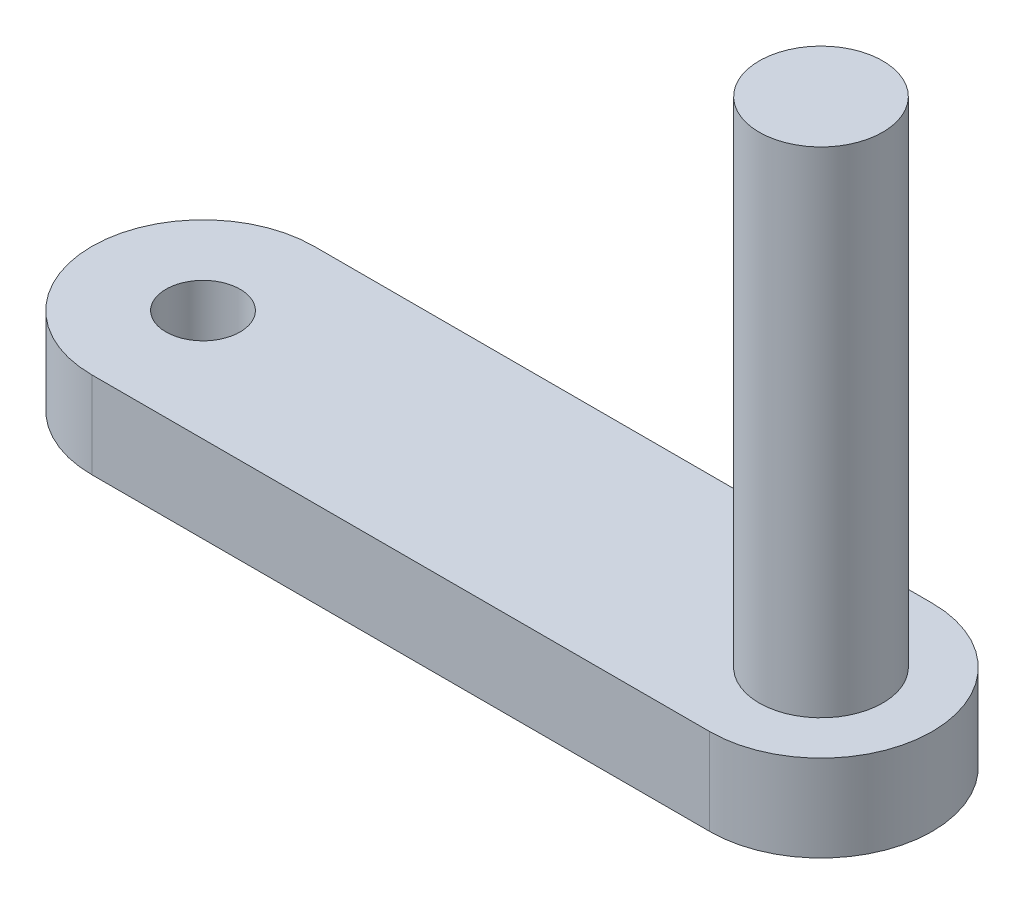
ISO-10303-21;
HEADER;
FILE_DESCRIPTION(('STEP AP214'),'2;1');
FILE_NAME('part.step','',(''),(''),'','','');
FILE_SCHEMA(('AUTOMOTIVE_DESIGN { 1 0 10303 214 1 1 1 1 }'));
ENDSEC;
DATA;
#1=APPLICATION_CONTEXT('core data for automotive mechanical design processes');
#2=APPLICATION_PROTOCOL_DEFINITION('international standard','automotive_design',2000,#1);
#3=PRODUCT_CONTEXT('',#1,'mechanical');
#4=PRODUCT('Part','Part','',(#3));
#5=PRODUCT_RELATED_PRODUCT_CATEGORY('part','',(#4));
#6=PRODUCT_DEFINITION_FORMATION('','',#4);
#7=PRODUCT_DEFINITION_CONTEXT('part definition',#1,'design');
#8=PRODUCT_DEFINITION('design','',#6,#7);
#9=PRODUCT_DEFINITION_SHAPE('','',#8);
#10=(LENGTH_UNIT() NAMED_UNIT(*) SI_UNIT(.MILLI.,.METRE.));
#11=(NAMED_UNIT(*) PLANE_ANGLE_UNIT() SI_UNIT($,.RADIAN.));
#12=(NAMED_UNIT(*) SI_UNIT($,.STERADIAN.) SOLID_ANGLE_UNIT());
#13=UNCERTAINTY_MEASURE_WITH_UNIT(LENGTH_MEASURE(1.E-05),#10,'distance_accuracy_value','');
#14=(GEOMETRIC_REPRESENTATION_CONTEXT(3) GLOBAL_UNCERTAINTY_ASSIGNED_CONTEXT((#13)) GLOBAL_UNIT_ASSIGNED_CONTEXT((#10,
#11,#12)) REPRESENTATION_CONTEXT('',''));
#15=CARTESIAN_POINT('',(0.,0.,0.));
#16=DIRECTION('',(0.,0.,1.));
#17=DIRECTION('',(1.,0.,0.));
#18=AXIS2_PLACEMENT_3D('',#15,#16,#17);
#19=CARTESIAN_POINT('',(-25.,7.,0.));
#20=DIRECTION('',(0.,1.,0.));
#21=DIRECTION('',(0.,0.,1.));
#22=AXIS2_PLACEMENT_3D('',#19,#20,#21);
#23=PLANE('',#22);
#24=CARTESIAN_POINT('',(25.,7.,0.));
#25=DIRECTION('',(0.,1.,0.));
#26=DIRECTION('',(0.,0.,1.));
#27=AXIS2_PLACEMENT_3D('',#24,#25,#26);
#28=CIRCLE('',#27,5.);
#29=CARTESIAN_POINT('',(25.,7.,5.));
#30=VERTEX_POINT('',#29);
#31=EDGE_CURVE('E124',#30,#30,#28,.T.);
#32=ORIENTED_EDGE('',*,*,#31,.F.);
#33=EDGE_LOOP('',(#32));
#34=FACE_BOUND('',#33,.T.);
#35=CARTESIAN_POINT('',(-25.,7.,0.));
#36=DIRECTION('',(0.,1.,0.));
#37=DIRECTION('',(0.,0.,1.));
#38=AXIS2_PLACEMENT_3D('',#35,#36,#37);
#39=CIRCLE('',#38,9.);
#40=CARTESIAN_POINT('',(-25.,7.,-9.));
#41=VERTEX_POINT('',#40);
#42=CARTESIAN_POINT('',(-25.,7.,9.));
#43=VERTEX_POINT('',#42);
#44=EDGE_CURVE('E85',#41,#43,#39,.T.);
#45=ORIENTED_EDGE('',*,*,#44,.T.);
#46=DIRECTION('',(1.,0.,0.));
#47=VECTOR('',#46,1.);
#48=CARTESIAN_POINT('',(-25.,7.,9.));
#49=LINE('',#48,#47);
#50=CARTESIAN_POINT('',(25.,7.,9.));
#51=VERTEX_POINT('',#50);
#52=EDGE_CURVE('E80',#43,#51,#49,.T.);
#53=ORIENTED_EDGE('',*,*,#52,.T.);
#54=CARTESIAN_POINT('',(25.,7.,0.));
#55=DIRECTION('',(0.,1.,0.));
#56=DIRECTION('',(0.,0.,1.));
#57=AXIS2_PLACEMENT_3D('',#54,#55,#56);
#58=CIRCLE('',#57,9.);
#59=CARTESIAN_POINT('',(25.,7.,-9.00000000000001));
#60=VERTEX_POINT('',#59);
#61=EDGE_CURVE('E83',#51,#60,#58,.T.);
#62=ORIENTED_EDGE('',*,*,#61,.T.);
#63=DIRECTION('',(-1.,0.,0.));
#64=VECTOR('',#63,1.);
#65=CARTESIAN_POINT('',(-25.,7.,-9.));
#66=LINE('',#65,#64);
#67=EDGE_CURVE('E50',#60,#41,#66,.T.);
#68=ORIENTED_EDGE('',*,*,#67,.T.);
#69=EDGE_LOOP('',(#45,#53,#62,#68));
#70=FACE_BOUND('',#69,.T.);
#71=CARTESIAN_POINT('',(-25.,7.,0.));
#72=DIRECTION('',(0.,1.,0.));
#73=DIRECTION('',(0.,0.,1.));
#74=AXIS2_PLACEMENT_3D('',#71,#72,#73);
#75=CIRCLE('',#74,3.);
#76=CARTESIAN_POINT('',(-25.,7.,3.));
#77=VERTEX_POINT('',#76);
#78=EDGE_CURVE('E114',#77,#77,#75,.T.);
#79=ORIENTED_EDGE('',*,*,#78,.F.);
#80=EDGE_LOOP('',(#79));
#81=FACE_BOUND('',#80,.T.);
#82=ADVANCED_FACE('F33',(#34,#70,#81),#23,.T.);
#83=CARTESIAN_POINT('',(-25.,0.,0.));
#84=DIRECTION('',(0.,1.,0.));
#85=DIRECTION('',(0.,0.,1.));
#86=AXIS2_PLACEMENT_3D('',#83,#84,#85);
#87=PLANE('',#86);
#88=CARTESIAN_POINT('',(-25.,0.,0.));
#89=DIRECTION('',(0.,1.,0.));
#90=DIRECTION('',(0.,0.,1.));
#91=AXIS2_PLACEMENT_3D('',#88,#89,#90);
#92=CIRCLE('',#91,9.);
#93=CARTESIAN_POINT('',(-25.,0.,-9.));
#94=VERTEX_POINT('',#93);
#95=CARTESIAN_POINT('',(-25.,0.,9.));
#96=VERTEX_POINT('',#95);
#97=EDGE_CURVE('E97',#94,#96,#92,.T.);
#98=ORIENTED_EDGE('',*,*,#97,.F.);
#99=DIRECTION('',(-1.,0.,0.));
#100=VECTOR('',#99,1.);
#101=CARTESIAN_POINT('',(-25.,0.,-9.));
#102=LINE('',#101,#100);
#103=CARTESIAN_POINT('',(25.,0.,-9.00000000000001));
#104=VERTEX_POINT('',#103);
#105=EDGE_CURVE('E73',#104,#94,#102,.T.);
#106=ORIENTED_EDGE('',*,*,#105,.F.);
#107=CARTESIAN_POINT('',(25.,0.,0.));
#108=DIRECTION('',(0.,1.,0.));
#109=DIRECTION('',(0.,0.,1.));
#110=AXIS2_PLACEMENT_3D('',#107,#108,#109);
#111=CIRCLE('',#110,9.);
#112=CARTESIAN_POINT('',(25.,0.,9.));
#113=VERTEX_POINT('',#112);
#114=EDGE_CURVE('E67',#113,#104,#111,.T.);
#115=ORIENTED_EDGE('',*,*,#114,.F.);
#116=DIRECTION('',(1.,0.,0.));
#117=VECTOR('',#116,1.);
#118=CARTESIAN_POINT('',(-25.,0.,9.));
#119=LINE('',#118,#117);
#120=EDGE_CURVE('E89',#96,#113,#119,.T.);
#121=ORIENTED_EDGE('',*,*,#120,.F.);
#122=EDGE_LOOP('',(#98,#106,#115,#121));
#123=FACE_BOUND('',#122,.T.);
#124=CARTESIAN_POINT('',(25.,0.,0.));
#125=DIRECTION('',(0.,1.,0.));
#126=DIRECTION('',(0.,0.,1.));
#127=AXIS2_PLACEMENT_3D('',#124,#125,#126);
#128=CIRCLE('',#127,4.);
#129=CARTESIAN_POINT('',(25.,0.,4.));
#130=VERTEX_POINT('',#129);
#131=EDGE_CURVE('E100',#130,#130,#128,.T.);
#132=ORIENTED_EDGE('',*,*,#131,.T.);
#133=EDGE_LOOP('',(#132));
#134=FACE_BOUND('',#133,.T.);
#135=CARTESIAN_POINT('',(-25.,0.,0.));
#136=DIRECTION('',(0.,1.,0.));
#137=DIRECTION('',(0.,0.,1.));
#138=AXIS2_PLACEMENT_3D('',#135,#136,#137);
#139=CIRCLE('',#138,3.);
#140=CARTESIAN_POINT('',(-25.,0.,3.));
#141=VERTEX_POINT('',#140);
#142=EDGE_CURVE('E115',#141,#141,#139,.T.);
#143=ORIENTED_EDGE('',*,*,#142,.T.);
#144=EDGE_LOOP('',(#143));
#145=FACE_BOUND('',#144,.T.);
#146=ADVANCED_FACE('F108',(#123,#134,#145),#87,.F.);
#147=CARTESIAN_POINT('',(-25.,7.,0.));
#148=DIRECTION('',(0.,-1.,0.));
#149=DIRECTION('',(0.,0.,-1.));
#150=AXIS2_PLACEMENT_3D('',#147,#148,#149);
#151=CYLINDRICAL_SURFACE('',#150,9.);
#152=ORIENTED_EDGE('',*,*,#97,.T.);
#153=DIRECTION('',(0.,-1.,0.));
#154=VECTOR('',#153,1.);
#155=CARTESIAN_POINT('',(-25.,7.,9.));
#156=LINE('',#155,#154);
#157=EDGE_CURVE('E11',#43,#96,#156,.T.);
#158=ORIENTED_EDGE('',*,*,#157,.F.);
#159=ORIENTED_EDGE('',*,*,#44,.F.);
#160=DIRECTION('',(0.,-1.,0.));
#161=VECTOR('',#160,1.);
#162=CARTESIAN_POINT('',(-25.,7.,-9.));
#163=LINE('',#162,#161);
#164=EDGE_CURVE('E93',#41,#94,#163,.T.);
#165=ORIENTED_EDGE('',*,*,#164,.T.);
#166=EDGE_LOOP('',(#152,#158,#159,#165));
#167=FACE_BOUND('',#166,.T.);
#168=ADVANCED_FACE('F35',(#167),#151,.T.);
#169=CARTESIAN_POINT('',(-25.,7.,9.));
#170=DIRECTION('',(0.,0.,-1.));
#171=DIRECTION('',(-1.,0.,0.));
#172=AXIS2_PLACEMENT_3D('',#169,#170,#171);
#173=PLANE('',#172);
#174=ORIENTED_EDGE('',*,*,#120,.T.);
#175=DIRECTION('',(0.,-1.,0.));
#176=VECTOR('',#175,1.);
#177=CARTESIAN_POINT('',(25.,7.,9.));
#178=LINE('',#177,#176);
#179=EDGE_CURVE('E42',#51,#113,#178,.T.);
#180=ORIENTED_EDGE('',*,*,#179,.F.);
#181=ORIENTED_EDGE('',*,*,#52,.F.);
#182=ORIENTED_EDGE('',*,*,#157,.T.);
#183=EDGE_LOOP('',(#174,#180,#181,#182));
#184=FACE_BOUND('',#183,.T.);
#185=ADVANCED_FACE('F88',(#184),#173,.F.);
#186=CARTESIAN_POINT('',(25.,7.,0.));
#187=DIRECTION('',(0.,-1.,0.));
#188=DIRECTION('',(0.,0.,-1.));
#189=AXIS2_PLACEMENT_3D('',#186,#187,#188);
#190=CYLINDRICAL_SURFACE('',#189,9.);
#191=ORIENTED_EDGE('',*,*,#114,.T.);
#192=DIRECTION('',(0.,-1.,0.));
#193=VECTOR('',#192,1.);
#194=CARTESIAN_POINT('',(25.,7.,-9.00000000000001));
#195=LINE('',#194,#193);
#196=EDGE_CURVE('E90',#60,#104,#195,.T.);
#197=ORIENTED_EDGE('',*,*,#196,.F.);
#198=ORIENTED_EDGE('',*,*,#61,.F.);
#199=ORIENTED_EDGE('',*,*,#179,.T.);
#200=EDGE_LOOP('',(#191,#197,#198,#199));
#201=FACE_BOUND('',#200,.T.);
#202=ADVANCED_FACE('F91',(#201),#190,.T.);
#203=CARTESIAN_POINT('',(-25.,7.,-9.));
#204=DIRECTION('',(0.,0.,1.));
#205=DIRECTION('',(1.,0.,0.));
#206=AXIS2_PLACEMENT_3D('',#203,#204,#205);
#207=PLANE('',#206);
#208=ORIENTED_EDGE('',*,*,#105,.T.);
#209=ORIENTED_EDGE('',*,*,#164,.F.);
#210=ORIENTED_EDGE('',*,*,#67,.F.);
#211=ORIENTED_EDGE('',*,*,#196,.T.);
#212=EDGE_LOOP('',(#208,#209,#210,#211));
#213=FACE_BOUND('',#212,.T.);
#214=ADVANCED_FACE('F105',(#213),#207,.F.);
#215=CARTESIAN_POINT('',(25.,7.,0.));
#216=DIRECTION('',(0.,-1.,0.));
#217=DIRECTION('',(0.,0.,-1.));
#218=AXIS2_PLACEMENT_3D('',#215,#216,#217);
#219=CYLINDRICAL_SURFACE('',#218,4.);
#220=CARTESIAN_POINT('',(25.,7.,0.));
#221=DIRECTION('',(0.,1.,0.));
#222=DIRECTION('',(0.,0.,1.));
#223=AXIS2_PLACEMENT_3D('',#220,#221,#222);
#224=CIRCLE('',#223,4.);
#225=CARTESIAN_POINT('',(25.,7.,4.));
#226=VERTEX_POINT('',#225);
#227=EDGE_CURVE('E118',#226,#226,#224,.T.);
#228=ORIENTED_EDGE('',*,*,#227,.T.);
#229=EDGE_LOOP('',(#228));
#230=FACE_BOUND('',#229,.T.);
#231=ORIENTED_EDGE('',*,*,#131,.F.);
#232=EDGE_LOOP('',(#231));
#233=FACE_BOUND('',#232,.T.);
#234=ADVANCED_FACE('F146',(#230,#233),#219,.F.);
#235=CARTESIAN_POINT('',(-25.,7.,0.));
#236=DIRECTION('',(0.,-1.,0.));
#237=DIRECTION('',(0.,0.,-1.));
#238=AXIS2_PLACEMENT_3D('',#235,#236,#237);
#239=CYLINDRICAL_SURFACE('',#238,3.);
#240=ORIENTED_EDGE('',*,*,#78,.T.);
#241=EDGE_LOOP('',(#240));
#242=FACE_BOUND('',#241,.T.);
#243=ORIENTED_EDGE('',*,*,#142,.F.);
#244=EDGE_LOOP('',(#243));
#245=FACE_BOUND('',#244,.T.);
#246=ADVANCED_FACE('F191',(#242,#245),#239,.F.);
#247=CARTESIAN_POINT('',(25.,7.,0.));
#248=DIRECTION('',(0.,1.,0.));
#249=DIRECTION('',(0.,0.,1.));
#250=AXIS2_PLACEMENT_3D('',#247,#248,#249);
#251=PLANE('',#250);
#252=ORIENTED_EDGE('',*,*,#227,.F.);
#253=EDGE_LOOP('',(#252));
#254=FACE_BOUND('',#253,.T.);
#255=ADVANCED_FACE('F135',(#254),#251,.F.);
#256=CARTESIAN_POINT('',(25.,47.,0.));
#257=DIRECTION('',(0.,-1.,0.));
#258=DIRECTION('',(0.,0.,-1.));
#259=AXIS2_PLACEMENT_3D('',#256,#257,#258);
#260=CYLINDRICAL_SURFACE('',#259,5.);
#261=CARTESIAN_POINT('',(25.,47.,0.));
#262=DIRECTION('',(0.,1.,0.));
#263=DIRECTION('',(0.,0.,1.));
#264=AXIS2_PLACEMENT_3D('',#261,#262,#263);
#265=CIRCLE('',#264,5.);
#266=CARTESIAN_POINT('',(25.,47.,5.));
#267=VERTEX_POINT('',#266);
#268=EDGE_CURVE('E123',#267,#267,#265,.T.);
#269=ORIENTED_EDGE('',*,*,#268,.F.);
#270=EDGE_LOOP('',(#269));
#271=FACE_BOUND('',#270,.T.);
#272=ORIENTED_EDGE('',*,*,#31,.T.);
#273=EDGE_LOOP('',(#272));
#274=FACE_BOUND('',#273,.T.);
#275=ADVANCED_FACE('F132',(#271,#274),#260,.T.);
#276=CARTESIAN_POINT('',(25.,47.,0.));
#277=DIRECTION('',(0.,1.,0.));
#278=DIRECTION('',(0.,0.,1.));
#279=AXIS2_PLACEMENT_3D('',#276,#277,#278);
#280=PLANE('',#279);
#281=ORIENTED_EDGE('',*,*,#268,.T.);
#282=EDGE_LOOP('',(#281));
#283=FACE_BOUND('',#282,.T.);
#284=ADVANCED_FACE('F130',(#283),#280,.T.);
#285=CLOSED_SHELL('',(#82,#146,#168,#185,#202,#214,#234,#246,#255,#275,#284));
#286=MANIFOLD_SOLID_BREP('B2',#285);
#287=ADVANCED_BREP_SHAPE_REPRESENTATION('',(#18,#286),#14);
#288=SHAPE_DEFINITION_REPRESENTATION(#9,#287);
ENDSEC;
END-ISO-10303-21;
